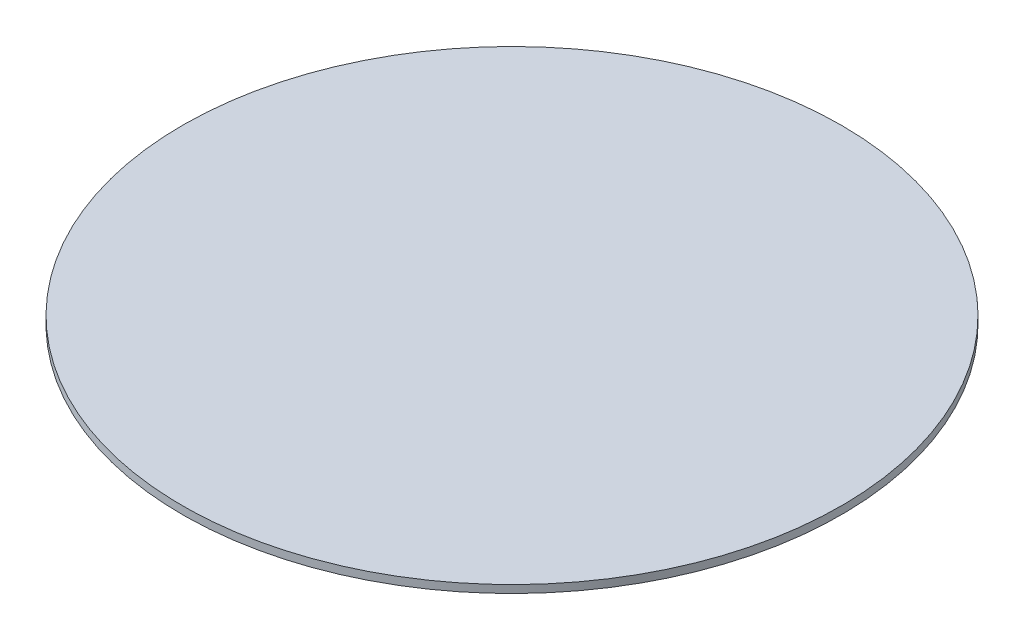
ISO-10303-21;
HEADER;
FILE_DESCRIPTION(('STEP AP214'),'2;1');
FILE_NAME('part.step','',(''),(''),'','','');
FILE_SCHEMA(('AUTOMOTIVE_DESIGN { 1 0 10303 214 1 1 1 1 }'));
ENDSEC;
DATA;
#1=APPLICATION_CONTEXT('core data for automotive mechanical design processes');
#2=APPLICATION_PROTOCOL_DEFINITION('international standard','automotive_design',2000,#1);
#3=PRODUCT_CONTEXT('',#1,'mechanical');
#4=PRODUCT('Part','Part','',(#3));
#5=PRODUCT_RELATED_PRODUCT_CATEGORY('part','',(#4));
#6=PRODUCT_DEFINITION_FORMATION('','',#4);
#7=PRODUCT_DEFINITION_CONTEXT('part definition',#1,'design');
#8=PRODUCT_DEFINITION('design','',#6,#7);
#9=PRODUCT_DEFINITION_SHAPE('','',#8);
#10=(LENGTH_UNIT() NAMED_UNIT(*) SI_UNIT(.MILLI.,.METRE.));
#11=(NAMED_UNIT(*) PLANE_ANGLE_UNIT() SI_UNIT($,.RADIAN.));
#12=(NAMED_UNIT(*) SI_UNIT($,.STERADIAN.) SOLID_ANGLE_UNIT());
#13=UNCERTAINTY_MEASURE_WITH_UNIT(LENGTH_MEASURE(1.E-05),#10,'distance_accuracy_value','');
#14=(GEOMETRIC_REPRESENTATION_CONTEXT(3) GLOBAL_UNCERTAINTY_ASSIGNED_CONTEXT((#13)) GLOBAL_UNIT_ASSIGNED_CONTEXT((#10,
#11,#12)) REPRESENTATION_CONTEXT('',''));
#15=CARTESIAN_POINT('',(0.,0.,0.));
#16=DIRECTION('',(0.,0.,1.));
#17=DIRECTION('',(1.,0.,0.));
#18=AXIS2_PLACEMENT_3D('',#15,#16,#17);
#19=CARTESIAN_POINT('',(-36.9763962360707,31.5037004370882,-6.22797338496424));
#20=CARTESIAN_POINT('',(-38.9954109325065,31.5037004370882,-6.22797338496424));
#21=CARTESIAN_POINT('',(-43.0334403253781,31.5037004370882,-5.83026220326284));
#22=CARTESIAN_POINT('',(-48.8577156071629,31.5037004370882,-4.06348761211722));
#23=CARTESIAN_POINT('',(-54.2253984486372,31.5037004370882,-1.19440135909718));
#24=CARTESIAN_POINT('',(-58.9302118084346,31.5037004370882,2.6667391800958));
#25=CARTESIAN_POINT('',(-62.7913523476276,31.5037004370882,7.37155253989311));
#26=CARTESIAN_POINT('',(-65.6604386006476,31.5037004370882,12.7392353813675));
#27=CARTESIAN_POINT('',(-67.4272131917932,31.5037004370882,18.5635106631522));
#28=CARTESIAN_POINT('',(-68.0237799643453,31.5037004370882,24.6205547524596));
#29=CARTESIAN_POINT('',(-67.4272131917932,31.5037004370882,30.677598841767));
#30=CARTESIAN_POINT('',(-65.6604386006476,31.5037004370882,36.5018741235518));
#31=CARTESIAN_POINT('',(-62.7913523476275,31.5037004370882,41.8695569650261));
#32=CARTESIAN_POINT('',(-58.9302118084346,31.5037004370882,46.5743703248234));
#33=CARTESIAN_POINT('',(-54.2253984486372,31.5037004370882,50.4355108640164));
#34=CARTESIAN_POINT('',(-48.8577156071629,31.5037004370882,53.3045971170364));
#35=CARTESIAN_POINT('',(-43.0334403253781,31.5037004370882,55.0713717081821));
#36=CARTESIAN_POINT('',(-36.9763962360708,31.5037004370882,55.6679384807342));
#37=CARTESIAN_POINT('',(-30.9193521467634,31.5037004370882,55.071371708182));
#38=CARTESIAN_POINT('',(-25.0950768649786,31.5037004370882,53.3045971170365));
#39=CARTESIAN_POINT('',(-19.7273940235042,31.5037004370882,50.4355108640164));
#40=CARTESIAN_POINT('',(-15.0225806637069,31.5037004370882,46.5743703248234));
#41=CARTESIAN_POINT('',(-11.1614401245139,31.5037004370882,41.8695569650261));
#42=CARTESIAN_POINT('',(-8.29235387149391,31.5037004370882,36.5018741235518));
#43=CARTESIAN_POINT('',(-6.5255792803483,31.5037004370882,30.677598841767));
#44=CARTESIAN_POINT('',(-5.92901250779618,31.5037004370882,24.6205547524596));
#45=CARTESIAN_POINT('',(-6.5255792803483,31.5037004370882,18.5635106631522));
#46=CARTESIAN_POINT('',(-8.29235387149391,31.5037004370882,12.7392353813675));
#47=CARTESIAN_POINT('',(-11.1614401245139,31.5037004370882,7.37155253989312));
#48=CARTESIAN_POINT('',(-15.0225806637069,31.5037004370882,2.6667391800958));
#49=CARTESIAN_POINT('',(-19.7273940235042,31.5037004370882,-1.19440135909717));
#50=CARTESIAN_POINT('',(-25.0950768649786,31.5037004370882,-4.06348761211721));
#51=CARTESIAN_POINT('',(-30.9193521467633,31.5037004370882,-5.83026220326283));
#52=CARTESIAN_POINT('',(-34.9573815396349,31.5037004370882,-6.22797338496424));
#53=CARTESIAN_POINT('',(-36.9763962360707,31.5037004370882,-6.22797338496424));
#54=B_SPLINE_CURVE_WITH_KNOTS('',3,(#19,#20,#21,#22,#23,#24,#25,#26,#27,#28,#29,#30,#31,#32,#33,
#34,#35,#36,#37,#38,#39,#40,#41,#42,#43,#44,#45,#46,#47,#48,#49,#50,#51,#52,#53),.UNSPECIFIED.,
.T.,.F.,(4,1,1,1,1,1,1,1,1,1,1,1,1,1,1,1,1,1,1,1,1,1,1,1,1,1,1,1,1,1,1,1,4),(0.,0.03125,0.0625,
0.09375,0.125,0.15625,0.1875,0.21875,0.25,0.28125,0.3125,0.34375,0.375,0.40625,0.4375,0.46875,
0.5,0.53125,0.5625,0.59375,0.625,0.65625,0.6875,0.71875,0.75,0.78125,0.8125,0.84375,0.875,
0.90625,0.9375,0.96875,1.),.UNSPECIFIED.);
#55=DIRECTION('',(0.,-1.,0.));
#56=VECTOR('',#55,1.);
#57=SURFACE_OF_LINEAR_EXTRUSION('',#54,#56);
#58=CARTESIAN_POINT('',(-36.9763962360707,31.5037004370882,-6.22797338496424));
#59=CARTESIAN_POINT('',(-36.4716394625916,31.5037004370882,-6.22797328026681));
#60=CARTESIAN_POINT('',(-35.9668863626681,31.5037004370882,-6.21554476210923));
#61=CARTESIAN_POINT('',(-34.9585924862172,31.5037004370882,-6.16595037345474));
#62=CARTESIAN_POINT('',(-34.4550517191375,31.5037004370882,-6.12878431080161));
#63=CARTESIAN_POINT('',(-33.45039536401,31.5037004370882,-6.02983431145543));
#64=CARTESIAN_POINT('',(-32.9492797759622,31.5037004370882,-5.96805037476238));
#65=CARTESIAN_POINT('',(-31.9506835542528,31.5037004370882,-5.81998328141761));
#66=CARTESIAN_POINT('',(-31.4532028923858,31.5037004370882,-5.73370031507532));
#67=CARTESIAN_POINT('',(-30.4630910036485,31.5037004370882,-5.53675481858584));
#68=CARTESIAN_POINT('',(-29.9704597767782,31.5037004370882,-5.42609228843864));
#69=CARTESIAN_POINT('',(-28.9912142717207,31.5037004370882,-5.18074218852991));
#70=CARTESIAN_POINT('',(-28.5046000403023,31.5037004370882,-5.04605443215123));
#71=CARTESIAN_POINT('',(-27.538552356766,31.5037004370882,-4.75300707154265));
#72=CARTESIAN_POINT('',(-27.059118904648,31.5037004370882,-4.59464746731273));
#73=CARTESIAN_POINT('',(-26.1085968074196,31.5037004370882,-4.25460896334027));
#74=CARTESIAN_POINT('',(-25.6375080975171,31.5037004370882,-4.07293024474754));
#75=CARTESIAN_POINT('',(-24.7048431125435,31.5037004370882,-3.68660775886208));
#76=CARTESIAN_POINT('',(-24.2432668374723,31.5037004370882,-3.48196399156935));
#77=CARTESIAN_POINT('',(-23.3307026845491,31.5037004370882,-3.0502869026937));
#78=CARTESIAN_POINT('',(-22.8797148889744,31.5037004370882,-2.82325340720358));
#79=CARTESIAN_POINT('',(-21.9894002462579,31.5037004370882,-2.3473703161755));
#80=CARTESIAN_POINT('',(-21.5500733991162,31.5037004370882,-2.09852072063753));
#81=CARTESIAN_POINT('',(-20.6841535382881,31.5037004370882,-1.57957829903695));
#82=CARTESIAN_POINT('',(-20.2575604257141,31.5037004370882,-1.3094856380031));
#83=CARTESIAN_POINT('',(-19.4181841151868,31.5037004370882,-0.748632318133596));
#84=CARTESIAN_POINT('',(-19.0054009172335,31.5037004370882,-0.457871659297951));
#85=CARTESIAN_POINT('',(-18.1945874508693,31.5037004370882,0.143543309820115));
#86=CARTESIAN_POINT('',(-17.7965572970824,31.5037004370882,0.454197774616647));
#87=CARTESIAN_POINT('',(-17.0161899860571,31.5037004370882,1.09462867583104));
#88=CARTESIAN_POINT('',(-16.6338528288188,31.5037004370882,1.42440511224891));
#89=CARTESIAN_POINT('',(-15.8858120194456,31.5037004370882,2.1023087852212));
#90=CARTESIAN_POINT('',(-15.5201082381276,31.5037004370882,2.45043587920988));
#91=CARTESIAN_POINT('',(-14.806277362821,31.5037004370882,3.16426675451651));
#92=CARTESIAN_POINT('',(-14.4581502688323,31.5037004370882,3.52997053583446));
#93=CARTESIAN_POINT('',(-13.78024659586,31.5037004370882,4.27801134520766));
#94=CARTESIAN_POINT('',(-13.4504701594422,31.5037004370882,4.66034850244605));
#95=CARTESIAN_POINT('',(-12.8100392582278,31.5037004370882,5.44071581347127));
#96=CARTESIAN_POINT('',(-12.4993847934312,31.5037004370882,5.83874596725812));
#97=CARTESIAN_POINT('',(-11.8979698243132,31.5037004370882,6.64955943362245));
#98=CARTESIAN_POINT('',(-11.6072091654775,31.5037004370882,7.06234263157594));
#99=CARTESIAN_POINT('',(-11.046355845608,31.5037004370882,7.90171894210266));
#100=CARTESIAN_POINT('',(-10.7762631845742,31.5037004370882,8.3283120546759));
#101=CARTESIAN_POINT('',(-10.2573207629735,31.5037004370882,9.19423191550614));
#102=CARTESIAN_POINT('',(-10.0084711674354,31.5037004370882,9.63355876265085));
#103=CARTESIAN_POINT('',(-9.53258807640774,31.5037004370882,10.5238734053592));
#104=CARTESIAN_POINT('',(-9.30555458091816,31.5037004370882,10.9748612009229));
#105=CARTESIAN_POINT('',(-8.87387749204102,31.5037004370882,11.8874253538763));
#106=CARTESIAN_POINT('',(-8.66923372474626,31.5037004370882,12.3490016289888));
#107=CARTESIAN_POINT('',(-8.28291123886637,31.5037004370882,13.2816666138497));
#108=CARTESIAN_POINT('',(-8.10123252028124,31.5037004370882,13.7527553235982));
#109=CARTESIAN_POINT('',(-7.761194016288,31.5037004370882,14.7032774212472));
#110=CARTESIAN_POINT('',(-7.60283441202973,31.5037004370882,15.1827108739398));
#111=CARTESIAN_POINT('',(-7.30978705149864,31.5037004370882,16.1487585559063));
#112=CARTESIAN_POINT('',(-7.17509929522583,31.5037004370882,16.6353727851801));
#113=CARTESIAN_POINT('',(-6.92974919502788,31.5037004370882,17.6146182960965));
#114=CARTESIAN_POINT('',(-6.81908666448559,31.5037004370882,18.1072495309703));
#115=CARTESIAN_POINT('',(-6.62214116907549,31.5037004370882,19.0973613978417));
#116=CARTESIAN_POINT('',(-6.53585820420768,31.5037004370882,19.5948420298395));
#117=CARTESIAN_POINT('',(-6.38779110683457,31.5037004370882,20.5934383331536));
#118=CARTESIAN_POINT('',(-6.32600716463868,31.5037004370882,21.0945540326765));
#119=CARTESIAN_POINT('',(-6.22705718032654,31.5037004370882,22.0992100832488));
#120=CARTESIAN_POINT('',(-6.1898911382103,31.5037004370882,22.6027504342983));
#121=CARTESIAN_POINT('',(-6.14029669344821,31.5037004370882,23.6110454473603));
#122=CARTESIAN_POINT('',(-6.12786809864689,31.5037004370882,24.11580009991));
#123=CARTESIAN_POINT('',(-6.12786809864689,31.5037004370882,25.1253094050093));
#124=CARTESIAN_POINT('',(-6.14029669344821,31.5037004370882,25.6300640575589));
#125=CARTESIAN_POINT('',(-6.1898911382103,31.5037004370882,26.638359070621));
#126=CARTESIAN_POINT('',(-6.22705718032654,31.5037004370882,27.1418994216704));
#127=CARTESIAN_POINT('',(-6.32600716463868,31.5037004370882,28.1465554722428));
#128=CARTESIAN_POINT('',(-6.38779110683457,31.5037004370882,28.6476711717657));
#129=CARTESIAN_POINT('',(-6.53585820420768,31.5037004370882,29.6462674750798));
#130=CARTESIAN_POINT('',(-6.6221411690755,31.5037004370882,30.1437481070775));
#131=CARTESIAN_POINT('',(-6.8190866644856,31.5037004370882,31.133859973949));
#132=CARTESIAN_POINT('',(-6.92974919502788,31.5037004370882,31.6264912088227));
#133=CARTESIAN_POINT('',(-7.17509929522583,31.5037004370882,32.6057367197391));
#134=CARTESIAN_POINT('',(-7.30978705149864,31.5037004370882,33.092350949013));
#135=CARTESIAN_POINT('',(-7.60283441202973,31.5037004370882,34.0583986309794));
#136=CARTESIAN_POINT('',(-7.76119401628801,31.5037004370882,34.537832083672));
#137=CARTESIAN_POINT('',(-8.10123252028124,31.5037004370882,35.488354181321));
#138=CARTESIAN_POINT('',(-8.28291123886637,31.5037004370882,35.9594428910695));
#139=CARTESIAN_POINT('',(-8.66923372474626,31.5037004370882,36.8921078759305));
#140=CARTESIAN_POINT('',(-8.87387749204102,31.5037004370882,37.3536841510429));
#141=CARTESIAN_POINT('',(-9.30555458091816,31.5037004370882,38.2662483039963));
#142=CARTESIAN_POINT('',(-9.53258807640774,31.5037004370882,38.71723609956));
#143=CARTESIAN_POINT('',(-10.0084711674354,31.5037004370882,39.6075507422684));
#144=CARTESIAN_POINT('',(-10.2573207629735,31.5037004370882,40.0468775894131));
#145=CARTESIAN_POINT('',(-10.7762631845742,31.5037004370882,40.9127974502433));
#146=CARTESIAN_POINT('',(-11.046355845608,31.5037004370882,41.3393905628166));
#147=CARTESIAN_POINT('',(-11.6072091654775,31.5037004370882,42.1787668733433));
#148=CARTESIAN_POINT('',(-11.8979698243132,31.5037004370882,42.5915500712968));
#149=CARTESIAN_POINT('',(-12.4993847934312,31.5037004370882,43.4023635376611));
#150=CARTESIAN_POINT('',(-12.8100392582278,31.5037004370882,43.800393691448));
#151=CARTESIAN_POINT('',(-13.4504701594422,31.5037004370882,44.5807610024732));
#152=CARTESIAN_POINT('',(-13.78024659586,31.5037004370882,44.9630981597116));
#153=CARTESIAN_POINT('',(-14.4581502688323,31.5037004370882,45.7111389690848));
#154=CARTESIAN_POINT('',(-14.806277362821,31.5037004370882,46.0768427504027));
#155=CARTESIAN_POINT('',(-15.5201082381276,31.5037004370882,46.7906736257094));
#156=CARTESIAN_POINT('',(-15.8858120194456,31.5037004370882,47.138800719698));
#157=CARTESIAN_POINT('',(-16.6338528288188,31.5037004370882,47.8167043926703));
#158=CARTESIAN_POINT('',(-17.0161899860572,31.5037004370882,48.1464808290882));
#159=CARTESIAN_POINT('',(-17.7965572970824,31.5037004370882,48.7869117303026));
#160=CARTESIAN_POINT('',(-18.1945874508692,31.5037004370882,49.0975661950991));
#161=CARTESIAN_POINT('',(-19.0054009172336,31.5037004370882,49.6989811642172));
#162=CARTESIAN_POINT('',(-19.418184115187,31.5037004370882,49.9897418230528));
#163=CARTESIAN_POINT('',(-20.2575604257138,31.5037004370882,50.5505951429223));
#164=CARTESIAN_POINT('',(-20.684153538287,31.5037004370882,50.8206878039561));
#165=CARTESIAN_POINT('',(-21.5500733991172,31.5037004370882,51.3396302255568));
#166=CARTESIAN_POINT('',(-21.989400246262,31.5037004370882,51.5884798210949));
#167=CARTESIAN_POINT('',(-22.8797148889704,31.5037004370882,52.0643629121226));
#168=CARTESIAN_POINT('',(-23.330702684534,31.5037004370882,52.2913964076122));
#169=CARTESIAN_POINT('',(-24.2432668374875,31.5037004370882,52.7230734964893));
#170=CARTESIAN_POINT('',(-24.7048431125999,31.5037004370882,52.9277172637841));
#171=CARTESIAN_POINT('',(-25.6375080974608,31.5037004370882,53.314039749664));
#172=CARTESIAN_POINT('',(-26.1085968072093,31.5037004370882,53.4957184682491));
#173=CARTESIAN_POINT('',(-27.0591189048583,31.5037004370882,53.8357569722424));
#174=CARTESIAN_POINT('',(-27.5385523575509,31.5037004370882,53.9941165765006));
#175=CARTESIAN_POINT('',(-28.5046000395174,31.5037004370882,54.2871639370317));
#176=CARTESIAN_POINT('',(-28.9912142687913,31.5037004370882,54.4218516933045));
#177=CARTESIAN_POINT('',(-29.9704597797076,31.5037004370882,54.6672017935025));
#178=CARTESIAN_POINT('',(-30.4630910145814,31.5037004370882,54.7778643240447));
#179=CARTESIAN_POINT('',(-31.4532028814529,31.5037004370882,54.9748098194548));
#180=CARTESIAN_POINT('',(-31.9506835134506,31.5037004370882,55.0610927843227));
#181=CARTESIAN_POINT('',(-32.9492798167647,31.5037004370882,55.2091598816958));
#182=CARTESIAN_POINT('',(-33.4503955162876,31.5037004370882,55.2709438238917));
#183=CARTESIAN_POINT('',(-34.4550515668599,31.5037004370882,55.3698938082038));
#184=CARTESIAN_POINT('',(-34.9585919179094,31.5037004370882,55.40705985032));
#185=CARTESIAN_POINT('',(-35.9668869309714,31.5037004370882,55.4566542950821));
#186=CARTESIAN_POINT('',(-36.4716415835211,31.5037004370882,55.4690828898835));
#187=CARTESIAN_POINT('',(-37.4811508886204,31.5037004370882,55.4690828898835));
#188=CARTESIAN_POINT('',(-37.98590554117,31.5037004370882,55.4566542950822));
#189=CARTESIAN_POINT('',(-38.9942005542321,31.5037004370882,55.4070598503201));
#190=CARTESIAN_POINT('',(-39.4977409052815,31.5037004370882,55.3698938082038));
#191=CARTESIAN_POINT('',(-40.5023969558539,31.5037004370882,55.2709438238917));
#192=CARTESIAN_POINT('',(-41.0035126553768,31.5037004370882,55.2091598816958));
#193=CARTESIAN_POINT('',(-42.0021089586909,31.5037004370882,55.0610927843227));
#194=CARTESIAN_POINT('',(-42.4995895906886,31.5037004370882,54.9748098194549));
#195=CARTESIAN_POINT('',(-43.4897014575601,31.5037004370882,54.7778643240448));
#196=CARTESIAN_POINT('',(-43.9823326924338,31.5037004370882,54.6672017935025));
#197=CARTESIAN_POINT('',(-44.9615782033502,31.5037004370882,54.4218516933045));
#198=CARTESIAN_POINT('',(-45.4481924326241,31.5037004370882,54.2871639370317));
#199=CARTESIAN_POINT('',(-46.4142401145905,31.5037004370882,53.9941165765006));
#200=CARTESIAN_POINT('',(-46.8936735672831,31.5037004370882,53.8357569722423));
#201=CARTESIAN_POINT('',(-47.8441956649322,31.5037004370882,53.4957184682491));
#202=CARTESIAN_POINT('',(-48.3152843746807,31.5037004370882,53.314039749664));
#203=CARTESIAN_POINT('',(-49.2479493595416,31.5037004370882,52.9277172637841));
#204=CARTESIAN_POINT('',(-49.709525634654,31.5037004370882,52.7230734964893));
#205=CARTESIAN_POINT('',(-50.6220897876074,31.5037004370882,52.2913964076122));
#206=CARTESIAN_POINT('',(-51.0730775831711,31.5037004370882,52.0643629121226));
#207=CARTESIAN_POINT('',(-51.9633922258795,31.5037004370882,51.5884798210949));
#208=CARTESIAN_POINT('',(-52.4027190730242,31.5037004370882,51.3396302255568));
#209=CARTESIAN_POINT('',(-53.2686389338544,31.5037004370882,50.8206878039561));
#210=CARTESIAN_POINT('',(-53.6952320464277,31.5037004370882,50.5505951429223));
#211=CARTESIAN_POINT('',(-54.5346083569544,31.5037004370882,49.9897418230529));
#212=CARTESIAN_POINT('',(-54.9473915549079,31.5037004370882,49.6989811642172));
#213=CARTESIAN_POINT('',(-55.7582050212722,31.5037004370882,49.0975661950991));
#214=CARTESIAN_POINT('',(-56.1562351750591,31.5037004370882,48.7869117303026));
#215=CARTESIAN_POINT('',(-56.9366024860843,31.5037004370882,48.1464808290882));
#216=CARTESIAN_POINT('',(-57.3189396433227,31.5037004370882,47.8167043926703));
#217=CARTESIAN_POINT('',(-58.0669804526959,31.5037004370882,47.138800719698));
#218=CARTESIAN_POINT('',(-58.4326842340138,31.5037004370882,46.7906736257094));
#219=CARTESIAN_POINT('',(-59.1465151093205,31.5037004370882,46.0768427504027));
#220=CARTESIAN_POINT('',(-59.4946422033092,31.5037004370882,45.7111389690848));
#221=CARTESIAN_POINT('',(-60.1725458762815,31.5037004370882,44.9630981597116));
#222=CARTESIAN_POINT('',(-60.5023223126993,31.5037004370882,44.5807610024732));
#223=CARTESIAN_POINT('',(-61.1427532139137,31.5037004370882,43.800393691448));
#224=CARTESIAN_POINT('',(-61.4534076787102,31.5037004370882,43.4023635376611));
#225=CARTESIAN_POINT('',(-62.0548226478283,31.5037004370882,42.5915500712968));
#226=CARTESIAN_POINT('',(-62.345583306664,31.5037004370882,42.1787668733433));
#227=CARTESIAN_POINT('',(-62.9064366265334,31.5037004370882,41.3393905628166));
#228=CARTESIAN_POINT('',(-63.1765292875672,31.5037004370882,40.9127974502433));
#229=CARTESIAN_POINT('',(-63.6954717091679,31.5037004370882,40.0468775894131));
#230=CARTESIAN_POINT('',(-63.944321304706,31.5037004370882,39.6075507422684));
#231=CARTESIAN_POINT('',(-64.4202043957337,31.5037004370882,38.71723609956));
#232=CARTESIAN_POINT('',(-64.6472378912233,31.5037004370882,38.2662483039963));
#233=CARTESIAN_POINT('',(-65.0789149801004,31.5037004370882,37.3536841510429));
#234=CARTESIAN_POINT('',(-65.2835587473952,31.5037004370882,36.8921078759305));
#235=CARTESIAN_POINT('',(-65.6698812332751,31.5037004370882,35.9594428910696));
#236=CARTESIAN_POINT('',(-65.8515599518602,31.5037004370882,35.4883541813211));
#237=CARTESIAN_POINT('',(-66.1915984558535,31.5037004370882,34.537832083672));
#238=CARTESIAN_POINT('',(-66.3499580601117,31.5037004370882,34.0583986309794));
#239=CARTESIAN_POINT('',(-66.6430054206428,31.5037004370882,33.092350949013));
#240=CARTESIAN_POINT('',(-66.7776931769156,31.5037004370882,32.6057367197391));
#241=CARTESIAN_POINT('',(-67.0230432771136,31.5037004370882,31.6264912088227));
#242=CARTESIAN_POINT('',(-67.1337058076559,31.5037004370882,31.133859973949));
#243=CARTESIAN_POINT('',(-67.330651303066,31.5037004370882,30.1437481070775));
#244=CARTESIAN_POINT('',(-67.4169342679338,31.5037004370882,29.6462674750798));
#245=CARTESIAN_POINT('',(-67.5650013653069,31.5037004370882,28.6476711717657));
#246=CARTESIAN_POINT('',(-67.6267853075028,31.5037004370882,28.1465554722428));
#247=CARTESIAN_POINT('',(-67.7257352918149,31.5037004370882,27.1418994216704));
#248=CARTESIAN_POINT('',(-67.7629013339312,31.5037004370882,26.638359070621));
#249=CARTESIAN_POINT('',(-67.8124957786933,31.5037004370882,25.6300640575589));
#250=CARTESIAN_POINT('',(-67.8249243734946,31.5037004370882,25.1253094050093));
#251=CARTESIAN_POINT('',(-67.8249243734946,31.5037004370882,24.11580009991));
#252=CARTESIAN_POINT('',(-67.8124957786933,31.5037004370882,23.6110454473603));
#253=CARTESIAN_POINT('',(-67.7629013339312,31.5037004370882,22.6027504342983));
#254=CARTESIAN_POINT('',(-67.7257352918149,31.5037004370882,22.0992100832488));
#255=CARTESIAN_POINT('',(-67.6267853075028,31.5037004370882,21.0945540326765));
#256=CARTESIAN_POINT('',(-67.5650013653069,31.5037004370882,20.5934383331536));
#257=CARTESIAN_POINT('',(-67.4169342679338,31.5037004370882,19.5948420298395));
#258=CARTESIAN_POINT('',(-67.330651303066,31.5037004370882,19.0973613978417));
#259=CARTESIAN_POINT('',(-67.1337058076559,31.5037004370882,18.1072495309703));
#260=CARTESIAN_POINT('',(-67.0230432771136,31.5037004370882,17.6146182960965));
#261=CARTESIAN_POINT('',(-66.7776931769156,31.5037004370882,16.6353727851801));
#262=CARTESIAN_POINT('',(-66.6430054206429,31.5037004370882,16.1487585559063));
#263=CARTESIAN_POINT('',(-66.3499580601118,31.5037004370882,15.1827108739398));
#264=CARTESIAN_POINT('',(-66.1915984558535,31.5037004370882,14.7032774212472));
#265=CARTESIAN_POINT('',(-65.8515599518602,31.5037004370882,13.7527553235982));
#266=CARTESIAN_POINT('',(-65.6698812332751,31.5037004370882,13.2816666138497));
#267=CARTESIAN_POINT('',(-65.2835587473952,31.5037004370882,12.3490016289887));
#268=CARTESIAN_POINT('',(-65.0789149801005,31.5037004370882,11.8874253538763));
#269=CARTESIAN_POINT('',(-64.6472378912233,31.5037004370882,10.9748612009229));
#270=CARTESIAN_POINT('',(-64.4202043957337,31.5037004370882,10.5238734053592));
#271=CARTESIAN_POINT('',(-63.9443213047061,31.5037004370882,9.63355876265084));
#272=CARTESIAN_POINT('',(-63.695471709168,31.5037004370882,9.19423191550613));
#273=CARTESIAN_POINT('',(-63.1765292875673,31.5037004370882,8.32831205467589));
#274=CARTESIAN_POINT('',(-62.9064366265335,31.5037004370882,7.90171894210265));
#275=CARTESIAN_POINT('',(-62.345583306664,31.5037004370882,7.06234263157593));
#276=CARTESIAN_POINT('',(-62.0548226478283,31.5037004370882,6.64955943362245));
#277=CARTESIAN_POINT('',(-61.4534076787103,31.5037004370882,5.83874596725811));
#278=CARTESIAN_POINT('',(-61.1427532139137,31.5037004370882,5.44071581347127));
#279=CARTESIAN_POINT('',(-60.5023223126993,31.5037004370882,4.66034850244604));
#280=CARTESIAN_POINT('',(-60.1725458762815,31.5037004370882,4.27801134520766));
#281=CARTESIAN_POINT('',(-59.4946422033092,31.5037004370882,3.52997053583446));
#282=CARTESIAN_POINT('',(-59.1465151093205,31.5037004370882,3.1642667545165));
#283=CARTESIAN_POINT('',(-58.4326842340139,31.5037004370882,2.45043587920988));
#284=CARTESIAN_POINT('',(-58.0669804526959,31.5037004370882,2.1023087852212));
#285=CARTESIAN_POINT('',(-57.3189396433227,31.5037004370882,1.4244051122489));
#286=CARTESIAN_POINT('',(-56.9366024860843,31.5037004370882,1.09462867583104));
#287=CARTESIAN_POINT('',(-56.1562351750591,31.5037004370882,0.454197774616641));
#288=CARTESIAN_POINT('',(-55.7582050212722,31.5037004370882,0.143543309820111));
#289=CARTESIAN_POINT('',(-54.947391554908,31.5037004370882,-0.457871659297958));
#290=CARTESIAN_POINT('',(-54.5346083569547,31.5037004370882,-0.748632318133606));
#291=CARTESIAN_POINT('',(-53.6952320464274,31.5037004370882,-1.30948563800311));
#292=CARTESIAN_POINT('',(-53.2686389338534,31.5037004370882,-1.57957829903696));
#293=CARTESIAN_POINT('',(-52.4027190730253,31.5037004370882,-2.09852072063754));
#294=CARTESIAN_POINT('',(-51.9633922258835,31.5037004370882,-2.3473703161755));
#295=CARTESIAN_POINT('',(-51.0730775831671,31.5037004370882,-2.82325340720358));
#296=CARTESIAN_POINT('',(-50.6220897875924,31.5037004370882,-3.05028690269371));
#297=CARTESIAN_POINT('',(-49.7095256346691,31.5037004370882,-3.48196399156936));
#298=CARTESIAN_POINT('',(-49.247949359598,31.5037004370882,-3.68660775886208));
#299=CARTESIAN_POINT('',(-48.3152843746243,31.5037004370882,-4.07293024474754));
#300=CARTESIAN_POINT('',(-47.8441956647219,31.5037004370882,-4.25460896334027));
#301=CARTESIAN_POINT('',(-46.8936735674935,31.5037004370882,-4.59464746731274));
#302=CARTESIAN_POINT('',(-46.4142401153755,31.5037004370882,-4.75300707154265));
#303=CARTESIAN_POINT('',(-45.4481924318391,31.5037004370882,-5.04605443215124));
#304=CARTESIAN_POINT('',(-44.9615782004207,31.5037004370882,-5.18074218852991));
#305=CARTESIAN_POINT('',(-43.9823326953633,31.5037004370882,-5.42609228843864));
#306=CARTESIAN_POINT('',(-43.489701468493,31.5037004370882,-5.53675481858584));
#307=CARTESIAN_POINT('',(-42.4995895797557,31.5037004370882,-5.73370031507533));
#308=CARTESIAN_POINT('',(-42.0021089178887,31.5037004370882,-5.81998328141761));
#309=CARTESIAN_POINT('',(-41.0035126961793,31.5037004370882,-5.96805037476238));
#310=CARTESIAN_POINT('',(-40.5023971081315,31.5037004370882,-6.02983431145543));
#311=CARTESIAN_POINT('',(-39.497740753004,31.5037004370882,-6.12878431080161));
#312=CARTESIAN_POINT('',(-38.9941999859243,31.5037004370882,-6.16595037345474));
#313=CARTESIAN_POINT('',(-37.9859061094734,31.5037004370882,-6.21554476210923));
#314=CARTESIAN_POINT('',(-37.4811530095499,31.5037004370882,-6.22797328026681));
#315=CARTESIAN_POINT('',(-36.9763962360707,31.5037004370882,-6.22797338496424));
#316=B_SPLINE_CURVE_WITH_KNOTS('',3,(#58,#59,#60,#61,#62,#63,#64,#65,#66,#67,#68,#69,#70,#71,
#72,#73,#74,#75,#76,#77,#78,#79,#80,#81,#82,#83,#84,#85,#86,#87,#88,#89,#90,#91,#92,#93,#94,#95,
#96,#97,#98,#99,#100,#101,#102,#103,#104,#105,#106,#107,#108,#109,#110,#111,#112,#113,#114,#115,
#116,#117,#118,#119,#120,#121,#122,#123,#124,#125,#126,#127,#128,#129,#130,#131,#132,#133,#134,
#135,#136,#137,#138,#139,#140,#141,#142,#143,#144,#145,#146,#147,#148,#149,#150,#151,#152,#153,
#154,#155,#156,#157,#158,#159,#160,#161,#162,#163,#164,#165,#166,#167,#168,#169,#170,#171,#172,
#173,#174,#175,#176,#177,#178,#179,#180,#181,#182,#183,#184,#185,#186,#187,#188,#189,#190,#191,
#192,#193,#194,#195,#196,#197,#198,#199,#200,#201,#202,#203,#204,#205,#206,#207,#208,#209,#210,
#211,#212,#213,#214,#215,#216,#217,#218,#219,#220,#221,#222,#223,#224,#225,#226,#227,#228,#229,
#230,#231,#232,#233,#234,#235,#236,#237,#238,#239,#240,#241,#242,#243,#244,#245,#246,#247,#248,
#249,#250,#251,#252,#253,#254,#255,#256,#257,#258,#259,#260,#261,#262,#263,#264,#265,#266,#267,
#268,#269,#270,#271,#272,#273,#274,#275,#276,#277,#278,#279,#280,#281,#282,#283,#284,#285,#286,
#287,#288,#289,#290,#291,#292,#293,#294,#295,#296,#297,#298,#299,#300,#301,#302,#303,#304,#305,
#306,#307,#308,#309,#310,#311,#312,#313,#314,#315),.UNSPECIFIED.,.F.,.F.,(4,2,2,2,2,2,2,2,2,2,2,
2,2,2,2,2,2,2,2,2,2,2,2,2,2,2,2,2,2,2,2,2,2,2,2,2,2,2,2,2,2,2,2,2,2,2,2,2,2,2,2,2,2,2,2,2,2,2,2,
2,2,2,2,2,2,2,2,2,2,2,2,2,2,2,2,2,2,2,2,2,2,2,2,2,2,2,2,2,2,2,2,2,2,2,2,2,2,2,2,2,2,2,2,2,2,2,2,
2,2,2,2,2,2,2,2,2,2,2,2,2,2,2,2,2,2,2,2,2,4),(0.,1.51411253544506,3.0282368323466,
4.54236112924813,6.05647366469319,7.57058620013825,9.08471049703978,10.5988347939413,
12.1129473293864,13.6270598648314,15.141184161733,16.6553084586345,18.1694209940796,
19.6835335295246,21.1976578264262,22.7117821233277,24.2258946587727,25.7400071942178,
27.2541314911193,28.7682557880209,30.2823683234659,31.796480858911,33.3106051558125,
34.8247294527141,36.3388419881591,37.8529545236042,39.3670788205057,40.8812031174072,
42.3953156528523,43.9094281882973,45.4235524851989,46.9376767821004,48.4517893175454,
49.9659018529905,51.480026149892,52.9941504467936,54.5082629822386,56.0223755176837,
57.5364998145852,59.0506241114867,60.5647366469318,62.0788491823768,63.5929734792784,
65.1070977761799,66.621210311625,68.13532284707,69.6494471439716,71.1635714408731,
72.6776839763182,74.1917965117632,75.7059208086647,77.2200451055663,78.7341576410113,
80.2482701764564,81.762394473358,83.2765187702595,84.7906313057046,86.3047438411496,
87.8188681380511,89.3329924349527,90.8471049703977,92.3612175058428,93.8753418027443,
95.3894660996459,96.9035786350909,98.417691170536,99.9318154674375,101.445939764339,
102.960052299784,104.474164835229,105.988289132131,107.502413429032,109.016525964477,
110.530638499922,112.044762796824,113.558887093725,115.07299962917,116.587112164616,
118.101236461517,119.615360758419,121.129473293864,122.643585829309,124.15771012621,
125.671834423112,127.185946958557,128.700059494002,130.214183790903,131.728308087805,
133.24242062325,134.756533158695,136.270657455597,137.784781752498,139.298894287943,
140.813006823388,142.32713112029,143.841255417191,145.355367952636,146.869480488082,
148.383604784983,149.897729081885,151.41184161733,152.925954152775,154.440078449676,
155.954202746578,157.468315282023,158.982427817468,160.496552114369,162.010676411271,
163.524788946716,165.038901482161,166.553025779063,168.067150075964,169.581262611409,
171.095375146854,172.609499443756,174.123623740657,175.637736276102,177.151848811548,
178.665973108449,180.180097405351,181.694209940796,183.208322476241,184.722446773142,
186.236571070044,187.750683605489,189.264796140934,190.778920437835,192.293044734737,
193.807157270182),.UNSPECIFIED.);
#317=CARTESIAN_POINT('',(-36.9763962360707,31.5037004370882,-6.22797338496424));
#318=VERTEX_POINT('',#317);
#319=EDGE_CURVE('E10',#318,#318,#316,.F.);
#320=ORIENTED_EDGE('',*,*,#319,.F.);
#321=EDGE_LOOP('',(#320));
#322=FACE_BOUND('',#321,.T.);
#323=CARTESIAN_POINT('',(-36.9763962360707,30.7769325240931,-6.22797338496424));
#324=CARTESIAN_POINT('',(-38.9954109325065,30.7769325240931,-6.22797338496424));
#325=CARTESIAN_POINT('',(-43.0334403253781,30.7769325240931,-5.83026220326284));
#326=CARTESIAN_POINT('',(-48.8577156071629,30.7769325240931,-4.06348761211722));
#327=CARTESIAN_POINT('',(-54.2253984486372,30.7769325240931,-1.19440135909718));
#328=CARTESIAN_POINT('',(-58.9302118084346,30.7769325240931,2.6667391800958));
#329=CARTESIAN_POINT('',(-62.7913523476276,30.7769325240931,7.37155253989311));
#330=CARTESIAN_POINT('',(-65.6604386006476,30.7769325240931,12.7392353813675));
#331=CARTESIAN_POINT('',(-67.4272131917932,30.7769325240931,18.5635106631522));
#332=CARTESIAN_POINT('',(-68.0237799643453,30.7769325240931,24.6205547524596));
#333=CARTESIAN_POINT('',(-67.4272131917932,30.7769325240931,30.677598841767));
#334=CARTESIAN_POINT('',(-65.6604386006476,30.7769325240931,36.5018741235518));
#335=CARTESIAN_POINT('',(-62.7913523476275,30.7769325240931,41.8695569650261));
#336=CARTESIAN_POINT('',(-58.9302118084346,30.7769325240931,46.5743703248234));
#337=CARTESIAN_POINT('',(-54.2253984486372,30.7769325240931,50.4355108640164));
#338=CARTESIAN_POINT('',(-48.8577156071629,30.7769325240931,53.3045971170364));
#339=CARTESIAN_POINT('',(-43.0334403253781,30.7769325240931,55.0713717081821));
#340=CARTESIAN_POINT('',(-36.9763962360708,30.7769325240931,55.6679384807342));
#341=CARTESIAN_POINT('',(-30.9193521467634,30.7769325240931,55.071371708182));
#342=CARTESIAN_POINT('',(-25.0950768649786,30.7769325240931,53.3045971170365));
#343=CARTESIAN_POINT('',(-19.7273940235042,30.7769325240931,50.4355108640164));
#344=CARTESIAN_POINT('',(-15.0225806637069,30.7769325240931,46.5743703248234));
#345=CARTESIAN_POINT('',(-11.1614401245139,30.7769325240931,41.8695569650261));
#346=CARTESIAN_POINT('',(-8.29235387149391,30.7769325240931,36.5018741235518));
#347=CARTESIAN_POINT('',(-6.5255792803483,30.7769325240931,30.677598841767));
#348=CARTESIAN_POINT('',(-5.92901250779618,30.7769325240931,24.6205547524596));
#349=CARTESIAN_POINT('',(-6.5255792803483,30.7769325240931,18.5635106631522));
#350=CARTESIAN_POINT('',(-8.29235387149391,30.7769325240931,12.7392353813675));
#351=CARTESIAN_POINT('',(-11.1614401245139,30.7769325240931,7.37155253989312));
#352=CARTESIAN_POINT('',(-15.0225806637069,30.7769325240931,2.6667391800958));
#353=CARTESIAN_POINT('',(-19.7273940235042,30.7769325240931,-1.19440135909717));
#354=CARTESIAN_POINT('',(-25.0950768649786,30.7769325240931,-4.06348761211721));
#355=CARTESIAN_POINT('',(-30.9193521467633,30.7769325240931,-5.83026220326283));
#356=CARTESIAN_POINT('',(-34.9573815396349,30.7769325240931,-6.22797338496424));
#357=CARTESIAN_POINT('',(-36.9763962360707,30.7769325240931,-6.22797338496424));
#358=B_SPLINE_CURVE_WITH_KNOTS('',3,(#323,#324,#325,#326,#327,#328,#329,#330,#331,#332,#333,
#334,#335,#336,#337,#338,#339,#340,#341,#342,#343,#344,#345,#346,#347,#348,#349,#350,#351,#352,
#353,#354,#355,#356,#357),.UNSPECIFIED.,.T.,.F.,(4,1,1,1,1,1,1,1,1,1,1,1,1,1,1,1,1,1,1,1,1,1,1,
1,1,1,1,1,1,1,1,1,4),(0.,0.03125,0.0625,0.09375,0.125,0.15625,0.1875,0.21875,0.25,0.28125,
0.3125,0.34375,0.375,0.40625,0.4375,0.46875,0.5,0.53125,0.5625,0.59375,0.625,0.65625,0.6875,
0.71875,0.75,0.78125,0.8125,0.84375,0.875,0.90625,0.9375,0.96875,1.),.UNSPECIFIED.);
#359=CARTESIAN_POINT('',(-36.9763962360707,30.7769325240931,-6.22797338496424));
#360=VERTEX_POINT('',#359);
#361=EDGE_CURVE('E25',#360,#360,#358,.T.);
#362=ORIENTED_EDGE('',*,*,#361,.T.);
#363=EDGE_LOOP('',(#362));
#364=FACE_BOUND('',#363,.T.);
#365=ADVANCED_FACE('F15',(#322,#364),#57,.F.);
#366=CARTESIAN_POINT('',(-36.9763962360707,31.5037004370882,-5.37944524754039));
#367=DIRECTION('',(0.,-1.,0.));
#368=DIRECTION('',(1.,0.,0.));
#369=AXIS2_PLACEMENT_3D('',#366,#367,#368);
#370=PLANE('',#369);
#371=ORIENTED_EDGE('',*,*,#319,.T.);
#372=EDGE_LOOP('',(#371));
#373=FACE_BOUND('',#372,.T.);
#374=ADVANCED_FACE('F60',(#373),#370,.F.);
#375=CARTESIAN_POINT('',(-36.9763962360707,30.7769325240931,-5.37944524754039));
#376=DIRECTION('',(0.,-1.,0.));
#377=DIRECTION('',(1.,0.,0.));
#378=AXIS2_PLACEMENT_3D('',#375,#376,#377);
#379=PLANE('',#378);
#380=ORIENTED_EDGE('',*,*,#361,.F.);
#381=EDGE_LOOP('',(#380));
#382=FACE_BOUND('',#381,.T.);
#383=ADVANCED_FACE('F68',(#382),#379,.T.);
#384=CLOSED_SHELL('',(#365,#374,#383));
#385=MANIFOLD_SOLID_BREP('B1',#384);
#386=ADVANCED_BREP_SHAPE_REPRESENTATION('',(#18,#385),#14);
#387=SHAPE_DEFINITION_REPRESENTATION(#9,#386);
ENDSEC;
END-ISO-10303-21;
